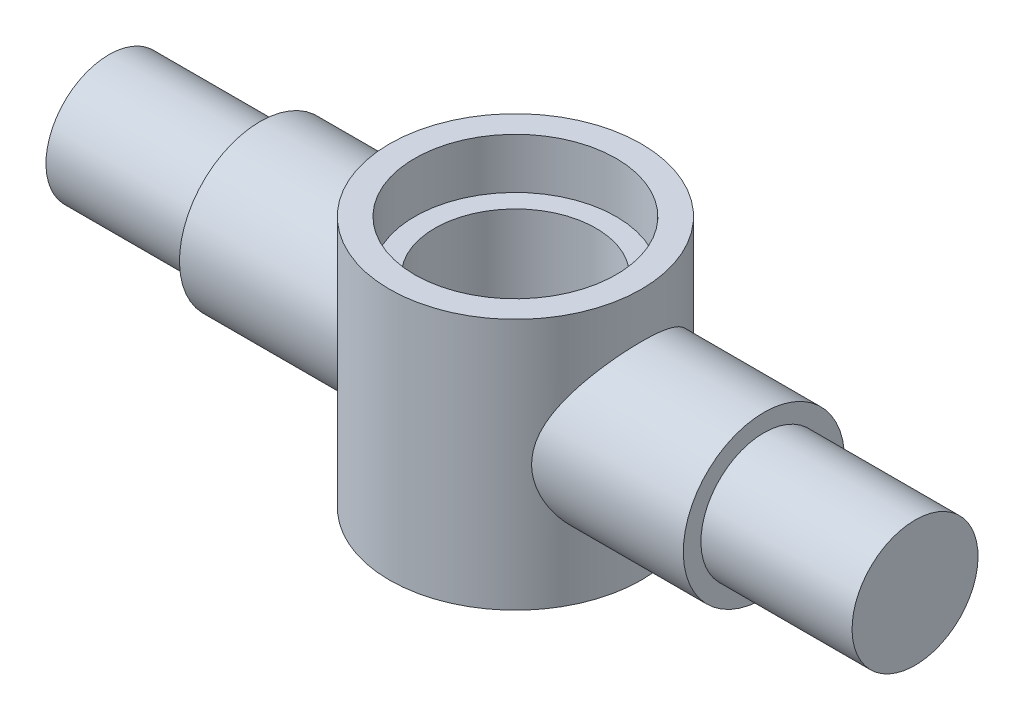
ISO-10303-21;
HEADER;
FILE_DESCRIPTION(('STEP AP214'),'2;1');
FILE_NAME('part.step','',(''),(''),'','','');
FILE_SCHEMA(('AUTOMOTIVE_DESIGN { 1 0 10303 214 1 1 1 1 }'));
ENDSEC;
DATA;
#1=APPLICATION_CONTEXT('core data for automotive mechanical design processes');
#2=APPLICATION_PROTOCOL_DEFINITION('international standard','automotive_design',2000,#1);
#3=PRODUCT_CONTEXT('',#1,'mechanical');
#4=PRODUCT('Part','Part','',(#3));
#5=PRODUCT_RELATED_PRODUCT_CATEGORY('part','',(#4));
#6=PRODUCT_DEFINITION_FORMATION('','',#4);
#7=PRODUCT_DEFINITION_CONTEXT('part definition',#1,'design');
#8=PRODUCT_DEFINITION('design','',#6,#7);
#9=PRODUCT_DEFINITION_SHAPE('','',#8);
#10=(LENGTH_UNIT() NAMED_UNIT(*) SI_UNIT(.MILLI.,.METRE.));
#11=(NAMED_UNIT(*) PLANE_ANGLE_UNIT() SI_UNIT($,.RADIAN.));
#12=(NAMED_UNIT(*) SI_UNIT($,.STERADIAN.) SOLID_ANGLE_UNIT());
#13=UNCERTAINTY_MEASURE_WITH_UNIT(LENGTH_MEASURE(1.E-05),#10,'distance_accuracy_value','');
#14=(GEOMETRIC_REPRESENTATION_CONTEXT(3) GLOBAL_UNCERTAINTY_ASSIGNED_CONTEXT((#13)) GLOBAL_UNIT_ASSIGNED_CONTEXT((#10,
#11,#12)) REPRESENTATION_CONTEXT('',''));
#15=CARTESIAN_POINT('',(0.,0.,0.));
#16=DIRECTION('',(0.,0.,1.));
#17=DIRECTION('',(1.,0.,0.));
#18=AXIS2_PLACEMENT_3D('',#15,#16,#17);
#19=CARTESIAN_POINT('',(25.,0.,0.));
#20=DIRECTION('',(0.,-1.,0.));
#21=DIRECTION('',(1.,0.,0.));
#22=AXIS2_PLACEMENT_3D('',#19,#20,#21);
#23=PLANE('',#22);
#24=CARTESIAN_POINT('',(25.,0.,0.));
#25=DIRECTION('',(0.,1.,0.));
#26=DIRECTION('',(-1.,0.,0.));
#27=AXIS2_PLACEMENT_3D('',#24,#25,#26);
#28=CIRCLE('',#27,25.);
#29=CARTESIAN_POINT('',(0.,0.,0.));
#30=VERTEX_POINT('',#29);
#31=EDGE_CURVE('E57',#30,#30,#28,.T.);
#32=ORIENTED_EDGE('',*,*,#31,.F.);
#33=EDGE_LOOP('',(#32));
#34=FACE_BOUND('',#33,.T.);
#35=CARTESIAN_POINT('',(25.,0.,0.));
#36=DIRECTION('',(0.,1.,0.));
#37=DIRECTION('',(0.,0.,1.));
#38=AXIS2_PLACEMENT_3D('',#35,#36,#37);
#39=CIRCLE('',#38,16.);
#40=CARTESIAN_POINT('',(25.,0.,16.));
#41=VERTEX_POINT('',#40);
#42=EDGE_CURVE('E114',#41,#41,#39,.T.);
#43=ORIENTED_EDGE('',*,*,#42,.T.);
#44=EDGE_LOOP('',(#43));
#45=FACE_BOUND('',#44,.T.);
#46=ADVANCED_FACE('F41',(#34,#45),#23,.T.);
#47=CARTESIAN_POINT('',(25.,50.,0.));
#48=DIRECTION('',(0.,1.,0.));
#49=DIRECTION('',(-1.,0.,0.));
#50=AXIS2_PLACEMENT_3D('',#47,#48,#49);
#51=CYLINDRICAL_SURFACE('',#50,25.);
#52=CARTESIAN_POINT('',(0.,8.99999999999998,0.));
#53=CARTESIAN_POINT('',(-1.56198817183265E-06,8.99999812268427,0.404925044071176));
#54=CARTESIAN_POINT('',(0.00985790233505375,9.0153900293615,0.809832411815946));
#55=CARTESIAN_POINT('',(0.0490489580311709,9.07673031711999,1.61652618236302));
#56=CARTESIAN_POINT('',(0.0783877374438591,9.12268997798419,2.01831137766447));
#57=CARTESIAN_POINT('',(0.15587135793951,9.24459012985987,2.81604821037114));
#58=CARTESIAN_POINT('',(0.204043418890826,9.32057401679456,3.2119905395922));
#59=CARTESIAN_POINT('',(0.318025996324268,9.50145916441724,3.99456099671031));
#60=CARTESIAN_POINT('',(0.383835120204193,9.60635814202158,4.38118985736236));
#61=CARTESIAN_POINT('',(0.531214452421046,9.84315317567685,5.1407660907412));
#62=CARTESIAN_POINT('',(0.612703810057813,9.97491094052897,5.51377244407855));
#63=CARTESIAN_POINT('',(0.789914415718777,10.2642840416398,6.24609510158277));
#64=CARTESIAN_POINT('',(0.885635895160982,10.4218997983604,6.60541118302289));
#65=CARTESIAN_POINT('',(1.0893675244986,10.7614332098507,7.30859986653981));
#66=CARTESIAN_POINT('',(1.19737463891809,10.9433448636325,7.65247625422317));
#67=CARTESIAN_POINT('',(1.42367453706457,11.3300437100849,8.32360019852907));
#68=CARTESIAN_POINT('',(1.54196863187976,11.5348338195922,8.6508456270696));
#69=CARTESIAN_POINT('',(1.79672487704247,11.9835171376261,9.31365412183655));
#70=CARTESIAN_POINT('',(1.93388176597135,12.2292380764864,9.64771274316307));
#71=CARTESIAN_POINT('',(2.21499359102065,12.7442633464195,10.2940617258667));
#72=CARTESIAN_POINT('',(2.35894883312868,13.0135687394739,10.6063511058609));
#73=CARTESIAN_POINT('',(2.6509977102151,13.5747907765348,11.2086687230747));
#74=CARTESIAN_POINT('',(2.79909650268537,13.8667364815179,11.4986673651025));
#75=CARTESIAN_POINT('',(3.09626559451641,14.4717980893445,12.0551203444099));
#76=CARTESIAN_POINT('',(3.24533592849056,14.7849147502183,12.3215738378621));
#77=CARTESIAN_POINT('',(3.56255008778447,15.4778002234219,12.8665793254927));
#78=CARTESIAN_POINT('',(3.73036103424933,15.8606856164832,13.1413799496497));
#79=CARTESIAN_POINT('',(4.05806208299021,16.651683814548,13.6575524379486));
#80=CARTESIAN_POINT('',(4.21795058661061,17.0598016741213,13.8989175727052));
#81=CARTESIAN_POINT('',(4.52401783406473,17.8994147531047,14.3459904698911));
#82=CARTESIAN_POINT('',(4.67021511563967,18.3308770771509,14.5517467761611));
#83=CARTESIAN_POINT('',(4.87478997105488,18.9943094460948,14.8320367864773));
#84=CARTESIAN_POINT('',(4.94052057748085,19.2181302463753,14.9207331379766));
#85=CARTESIAN_POINT('',(5.06634220571869,19.6710181010992,15.0884150598226));
#86=CARTESIAN_POINT('',(5.12643179941326,19.9000864658898,15.16739817266));
#87=CARTESIAN_POINT('',(5.2663051614987,20.4694477074645,15.3492623867947));
#88=CARTESIAN_POINT('',(5.3424522923507,20.8124861079796,15.4464497728831));
#89=CARTESIAN_POINT('',(5.47864152649098,21.5072346310028,15.6182136002394));
#90=CARTESIAN_POINT('',(5.53868772922925,21.8589425212266,15.6927957976356));
#91=CARTESIAN_POINT('',(5.64055970012612,22.5687302729839,15.8183001813279));
#92=CARTESIAN_POINT('',(5.68240831601843,22.9268015533606,15.8692520417559));
#93=CARTESIAN_POINT('',(5.74640434767621,23.6473419871101,15.9468367737907));
#94=CARTESIAN_POINT('',(5.76855154531203,24.0098111891308,15.9734693761403));
#95=CARTESIAN_POINT('',(5.79228706590541,24.7375398438493,16.0020035959886));
#96=CARTESIAN_POINT('',(5.79381096430315,25.1028044753721,16.0038277150333));
#97=CARTESIAN_POINT('',(5.77607024225664,25.8320914603995,15.9825126443981));
#98=CARTESIAN_POINT('',(5.75680551855,26.1961138077242,15.9593733307184));
#99=CARTESIAN_POINT('',(5.69825328720914,26.9203732822328,15.8885074198919));
#100=CARTESIAN_POINT('',(5.65895143825952,27.2806075093763,15.8407632118421));
#101=CARTESIAN_POINT('',(5.56183755255319,27.9945423910845,15.7214419318028));
#102=CARTESIAN_POINT('',(5.50402512600332,28.3482429078974,15.6498643579324));
#103=CARTESIAN_POINT('',(5.37392609689849,29.0365255860999,15.4863735674023));
#104=CARTESIAN_POINT('',(5.30212904417278,29.3713625698905,15.3951393603923));
#105=CARTESIAN_POINT('',(5.14517471683057,30.0316039752163,15.1921818732878));
#106=CARTESIAN_POINT('',(5.06001220526633,30.3570046398833,15.0804505589621));
#107=CARTESIAN_POINT('',(4.78783415965827,31.3172990085978,14.7159808896165));
#108=CARTESIAN_POINT('',(4.58405304140301,31.9366594201912,14.4338764142666));
#109=CARTESIAN_POINT('',(4.23727798199094,32.8867098662818,13.9270311591719));
#110=CARTESIAN_POINT('',(4.10287906979833,33.2331517366573,13.7249831568112));
#111=CARTESIAN_POINT('',(3.82778712483943,33.9082848078003,13.296696161189));
#112=CARTESIAN_POINT('',(3.68709350496816,34.2369743464777,13.0704549086854));
#113=CARTESIAN_POINT('',(3.40245640812741,34.8760245507426,12.5945655171766));
#114=CARTESIAN_POINT('',(3.25850961235503,35.1863652117508,12.3448925721126));
#115=CARTESIAN_POINT('',(2.97043516498369,35.7875537186817,11.823159163581));
#116=CARTESIAN_POINT('',(2.82630750299215,36.0784003868203,11.5510973496357));
#117=CARTESIAN_POINT('',(2.51454967621855,36.6908990129197,10.9336594778248));
#118=CARTESIAN_POINT('',(2.34743237586854,37.0084814733917,10.5839664649273));
#119=CARTESIAN_POINT('',(2.0211665453896,37.6131505683738,9.85558430354047));
#120=CARTESIAN_POINT('',(1.86201934833122,37.9002321102804,9.47689033099586));
#121=CARTESIAN_POINT('',(1.55600485087544,38.4413788795507,8.69230147452351));
#122=CARTESIAN_POINT('',(1.40912715251859,38.695472166599,8.28643015897212));
#123=CARTESIAN_POINT('',(1.20101324501069,39.0499422909588,7.65877791158845));
#124=CARTESIAN_POINT('',(1.13367950310593,39.1636478233454,7.44643333273027));
#125=CARTESIAN_POINT('',(1.00351676923808,39.3818943973732,7.01565570471913));
#126=CARTESIAN_POINT('',(0.94068894082306,39.4864330734262,6.79722110303668));
#127=CARTESIAN_POINT('',(0.783640362018523,39.7461292462035,6.22117702909599));
#128=CARTESIAN_POINT('',(0.693335416986595,39.8937970331853,5.85907262264253));
#129=CARTESIAN_POINT('',(0.527428956598975,40.1630462524394,5.12210088957014));
#130=CARTESIAN_POINT('',(0.451824793582059,40.2846323825155,4.74723587549781));
#131=CARTESIAN_POINT('',(0.316959128254057,40.5003093339702,3.98702789616476));
#132=CARTESIAN_POINT('',(0.257687543459783,40.5944171205238,3.60169155725472));
#133=CARTESIAN_POINT('',(0.156776698850457,40.7540335011103,2.82284294906273));
#134=CARTESIAN_POINT('',(0.115137766127057,40.8195415646094,2.42933052825374));
#135=CARTESIAN_POINT('',(0.0503760700251214,40.9212210484698,1.63564062619807));
#136=CARTESIAN_POINT('',(0.0273166832826481,40.9572920615261,1.23544504541874));
#137=CARTESIAN_POINT('',(0.000522238686042498,40.9991921444795,0.432822676299676));
#138=CARTESIAN_POINT('',(-0.00321281500696168,41.0050212078647,0.0303958874795079));
#139=CARTESIAN_POINT('',(0.00873491924922769,40.9863498172394,-0.773483996299116));
#140=CARTESIAN_POINT('',(0.0244188676198412,40.9618475507195,-1.17493703163257));
#141=CARTESIAN_POINT('',(0.0748163028941737,40.8828746268655,-1.97366097901498));
#142=CARTESIAN_POINT('',(0.109529296940924,40.8284047456999,-2.37093199910756));
#143=CARTESIAN_POINT('',(0.19479999586677,40.6939634497678,-3.13731209509082));
#144=CARTESIAN_POINT('',(0.244414961139862,40.6155053701039,-3.50679388900719));
#145=CARTESIAN_POINT('',(0.358894978839578,40.4333752681049,-4.23704308721496));
#146=CARTESIAN_POINT('',(0.423759366555056,40.3297043447724,-4.59781087058803));
#147=CARTESIAN_POINT('',(0.56745104564592,40.098267274378,-5.30867908099267));
#148=CARTESIAN_POINT('',(0.646279255035377,39.9704995431003,-5.65877880490657));
#149=CARTESIAN_POINT('',(0.816413763687928,39.6921060234087,-6.34662960165231));
#150=CARTESIAN_POINT('',(0.907720748724976,39.5414789787058,-6.68437999452994));
#151=CARTESIAN_POINT('',(1.10837242571746,39.2066584791476,-7.37070229752058));
#152=CARTESIAN_POINT('',(1.21855262927319,39.0208041517277,-7.71821923165124));
#153=CARTESIAN_POINT('',(1.44932169160555,38.6257168103069,-8.3960563865157));
#154=CARTESIAN_POINT('',(1.56991095850302,38.4164828795387,-8.72637593215575));
#155=CARTESIAN_POINT('',(1.81936979553602,37.9759241468037,-9.36895085200484));
#156=CARTESIAN_POINT('',(1.94824443890384,37.7445857670566,-9.6811949317172));
#157=CARTESIAN_POINT('',(2.21193981612649,37.2611877169458,-10.2865613887257));
#158=CARTESIAN_POINT('',(2.34676115136016,37.009125948624,-10.579681824615));
#159=CARTESIAN_POINT('',(2.64087062970049,36.4453931745428,-11.1893099340712));
#160=CARTESIAN_POINT('',(2.80075163463286,36.1304967694322,-11.5025558397825));
#161=CARTESIAN_POINT('',(3.12155940671436,35.4760453865055,-12.1016246389837));
#162=CARTESIAN_POINT('',(3.28248631967847,35.1364869002432,-12.3874436172205));
#163=CARTESIAN_POINT('',(3.60141915799818,34.4338377487856,-12.9305814468634));
#164=CARTESIAN_POINT('',(3.75942434435982,34.0707412319717,-13.1878931678842));
#165=CARTESIAN_POINT('',(4.06814384156568,33.322188513059,-13.6725981697187));
#166=CARTESIAN_POINT('',(4.21885925415272,32.9367357092736,-13.8999959805734));
#167=CARTESIAN_POINT('',(4.48857514280194,32.1986041155744,-14.2944225726149));
#168=CARTESIAN_POINT('',(4.60909837899761,31.848619370483,-14.4654551193313));
#169=CARTESIAN_POINT('',(4.83794259523465,31.1337720024687,-14.7827501975162));
#170=CARTESIAN_POINT('',(4.94626594273744,30.768912284905,-14.9290175376039));
#171=CARTESIAN_POINT('',(5.14723099845127,30.0259469850898,-15.1952420148147));
#172=CARTESIAN_POINT('',(5.23988958207276,29.6478561935389,-15.315227506719));
#173=CARTESIAN_POINT('',(5.40630246864348,28.8798750466482,-15.5275641940392));
#174=CARTESIAN_POINT('',(5.48005700535616,28.4899848372842,-15.6199157311731));
#175=CARTESIAN_POINT('',(5.60619433125048,27.6970861474701,-15.7762650376));
#176=CARTESIAN_POINT('',(5.65836362765541,27.2939872883618,-15.8399800811272));
#177=CARTESIAN_POINT('',(5.73781016824664,26.4816447778462,-15.9364986807434));
#178=CARTESIAN_POINT('',(5.76508805633217,26.0724012856687,-15.9693030364411));
#179=CARTESIAN_POINT('',(5.79334753544912,25.2519378820147,-16.0032809353728));
#180=CARTESIAN_POINT('',(5.79434525574141,24.8407193377404,-16.004473879882));
#181=CARTESIAN_POINT('',(5.77002719436439,24.0202173807875,-15.9752468012828));
#182=CARTESIAN_POINT('',(5.74471350954019,23.6109338165146,-15.9448292973182));
#183=CARTESIAN_POINT('',(5.6745654276942,22.8570140229211,-15.8596997261338));
#184=CARTESIAN_POINT('',(5.63308014526847,22.5115818283466,-15.8091331210736));
#185=CARTESIAN_POINT('',(5.5332827598235,21.8270252370755,-15.6860828655746));
#186=CARTESIAN_POINT('',(5.47496587319737,21.487902662804,-15.6135929841754));
#187=CARTESIAN_POINT('',(5.34334206526721,20.8176192579242,-15.4475564981701));
#188=CARTESIAN_POINT('',(5.27002562100976,20.4864636354068,-15.3539965127063));
#189=CARTESIAN_POINT('',(5.11053527613486,19.8336626652014,-15.1468238889593));
#190=CARTESIAN_POINT('',(5.02435963878908,19.5120186091617,-15.0332085416725));
#191=CARTESIAN_POINT('',(4.80975133743428,18.7700652037405,-14.7443693949179));
#192=CARTESIAN_POINT('',(4.6769968019824,18.3539982028307,-14.5614134998204));
#193=CARTESIAN_POINT('',(4.39744308159849,17.5427585234968,-14.1631148541737));
#194=CARTESIAN_POINT('',(4.2506442411209,17.1475853329942,-13.9477728978596));
#195=CARTESIAN_POINT('',(3.94768637908642,16.3788126586156,-13.4861556789325));
#196=CARTESIAN_POINT('',(3.79151583694121,16.0052408841273,-13.239841918056));
#197=CARTESIAN_POINT('',(3.4745067895303,15.2813195028843,-12.7179541719606));
#198=CARTESIAN_POINT('',(3.31366862870541,14.93096818884,-12.442382341833));
#199=CARTESIAN_POINT('',(2.98955776120199,14.2505775929872,-11.8597161505609));
#200=CARTESIAN_POINT('',(2.82627873933888,13.9208271398851,-11.5522878757903));
#201=CARTESIAN_POINT('',(2.50319754923522,13.2876022988094,-10.9097759508097));
#202=CARTESIAN_POINT('',(2.34339545410566,12.9841284629678,-10.5746917197737));
#203=CARTESIAN_POINT('',(2.0310418354948,12.4050614601661,-9.87788824812155));
#204=CARTESIAN_POINT('',(1.87849117772162,12.1294716177083,-9.51616584039962));
#205=CARTESIAN_POINT('',(1.65793781534625,11.7386501085569,-8.95480859407568));
#206=CARTESIAN_POINT('',(1.58579787540543,11.6121352502278,-8.76455786261007));
#207=CARTESIAN_POINT('',(1.44467629196686,11.3668292969539,-8.37789362684303));
#208=CARTESIAN_POINT('',(1.3756958404031,11.2480411099519,-8.18147784307569));
#209=CARTESIAN_POINT('',(1.16992553024818,10.8964762827568,-7.57072389698189));
#210=CARTESIAN_POINT('',(1.03901859790707,10.676789491621,-7.14672497942354));
#211=CARTESIAN_POINT('',(0.796420721132362,10.2745460712871,-6.27620668494683));
#212=CARTESIAN_POINT('',(0.684726454607826,10.0919830219705,-5.82969121870037));
#213=CARTESIAN_POINT('',(0.534289367298164,9.84826640160568,-5.14619804504744));
#214=CARTESIAN_POINT('',(0.487036317800453,9.77211504150387,-4.91633650685713));
#215=CARTESIAN_POINT('',(0.398539575824231,9.63006387098504,-4.45240645515483));
#216=CARTESIAN_POINT('',(0.35729424601443,9.56416126706104,-4.21833910749464));
#217=CARTESIAN_POINT('',(0.243139111243967,9.3823442661252,-3.51078593222693));
#218=CARTESIAN_POINT('',(0.179719774870797,9.28217522221578,-3.03154239159495));
#219=CARTESIAN_POINT('',(0.0871442856579882,9.13642371285529,-2.12784973800437));
#220=CARTESIAN_POINT('',(0.0545463103916828,9.08534244988568,-1.70461817648607));
#221=CARTESIAN_POINT('',(0.0109747468669737,9.01713119969598,-0.85425124641092));
#222=CARTESIAN_POINT('',(1.64758841984371E-06,9.00000198019656,-0.427115789798921));
#223=CARTESIAN_POINT('',(0.,8.99999999999998,0.));
#224=B_SPLINE_CURVE_WITH_KNOTS('',3,(#52,#53,#54,#55,#56,#57,#58,#59,#60,#61,#62,#63,#64,#65,
#66,#67,#68,#69,#70,#71,#72,#73,#74,#75,#76,#77,#78,#79,#80,#81,#82,#83,#84,#85,#86,#87,#88,#89,
#90,#91,#92,#93,#94,#95,#96,#97,#98,#99,#100,#101,#102,#103,#104,#105,#106,#107,#108,#109,#110,
#111,#112,#113,#114,#115,#116,#117,#118,#119,#120,#121,#122,#123,#124,#125,#126,#127,#128,#129,
#130,#131,#132,#133,#134,#135,#136,#137,#138,#139,#140,#141,#142,#143,#144,#145,#146,#147,#148,
#149,#150,#151,#152,#153,#154,#155,#156,#157,#158,#159,#160,#161,#162,#163,#164,#165,#166,#167,
#168,#169,#170,#171,#172,#173,#174,#175,#176,#177,#178,#179,#180,#181,#182,#183,#184,#185,#186,
#187,#188,#189,#190,#191,#192,#193,#194,#195,#196,#197,#198,#199,#200,#201,#202,#203,#204,#205,
#206,#207,#208,#209,#210,#211,#212,#213,#214,#215,#216,#217,#218,#219,#220,#221,#222,#223),
.UNSPECIFIED.,.T.,.F.,(4,2,2,2,2,2,2,2,2,2,2,2,2,2,2,2,2,2,2,2,2,2,2,2,2,2,2,2,2,2,2,2,2,2,2,2,
2,2,2,2,2,2,2,2,2,2,2,2,2,2,2,2,2,2,2,2,2,2,2,2,2,2,2,2,2,2,2,2,2,2,2,2,2,2,2,2,2,2,2,2,2,2,2,2,
2,4),(0.,1.21433590372909,2.42912015739384,3.64566667645103,4.86211716668029,6.07245576879059,
7.2828140534746,8.49287393554705,9.70308826789616,11.0121682302353,12.3213071693168,
13.6321552474755,14.9430502856901,16.4420715483407,17.9413940741466,19.4386562617971,
20.1870950354631,20.9357227808739,22.0283192451477,23.1206372592161,24.2115798402962,
25.3025344998955,26.3968963790282,27.4912636941612,28.5864153906037,29.6815901501144,
30.7437087697947,31.8062446000701,33.9301496941282,35.1981954835546,36.4663597906896,
37.7358821242904,39.0054810906213,40.5068568446586,42.0084828841258,43.5088231589307,
44.258900518937,45.0091708768569,46.2118707177269,47.4143537471899,48.6160927841587,
49.8178541128161,51.0236976145029,52.2295413758452,53.4354571982781,54.6413417886698,
55.7829773658004,56.9245631890967,58.0662240907687,59.2079477579223,60.4343408374661,
61.6607820235585,62.8879814611389,64.1153052891324,65.5300085169597,66.9449133972259,
68.3601713857365,69.775214806001,70.997381541078,72.2193106972438,73.439914981646,
74.6605041715842,75.8928927793549,77.1252495063834,78.3568498658442,79.5883520824207,
80.6419106900126,81.6957690183668,82.7502985106615,83.8049705540183,85.2234889733917,
86.6419726107123,88.0622371979518,89.4823972438031,90.9193332530907,92.3562994483688,
93.7934367662636,94.5120249362064,95.2308820013993,96.7140532599454,98.1969678027555,
98.9368252382388,99.6764806557275,101.154474230587,102.435329338598,103.716213408864),.UNSPECIFIED.);
#225=CARTESIAN_POINT('',(0.,8.99999999999998,0.));
#226=VERTEX_POINT('',#225);
#227=EDGE_CURVE('E10',#226,#226,#224,.T.);
#228=ORIENTED_EDGE('',*,*,#227,.F.);
#229=EDGE_LOOP('',(#228));
#230=FACE_BOUND('',#229,.T.);
#231=CARTESIAN_POINT('',(50.,41.,0.));
#232=CARTESIAN_POINT('',(50.0000015619882,41.0000018773157,0.404925044071176));
#233=CARTESIAN_POINT('',(49.990142097665,40.9846099706385,0.809832411815946));
#234=CARTESIAN_POINT('',(49.9509510419688,40.92326968288,1.61652618236302));
#235=CARTESIAN_POINT('',(49.9216122625562,40.8773100220158,2.01831137766447));
#236=CARTESIAN_POINT('',(49.8441286420605,40.7554098701401,2.81604821037115));
#237=CARTESIAN_POINT('',(49.7959565811092,40.6794259832054,3.2119905395922));
#238=CARTESIAN_POINT('',(49.6819740036757,40.4985408355827,3.99456099671031));
#239=CARTESIAN_POINT('',(49.6161648797958,40.3936418579784,4.38118985736236));
#240=CARTESIAN_POINT('',(49.468785547579,40.1568468243231,5.1407660907412));
#241=CARTESIAN_POINT('',(49.3872961899422,40.025089059471,5.51377244407855));
#242=CARTESIAN_POINT('',(49.2100855842812,39.7357159583602,6.24609510158277));
#243=CARTESIAN_POINT('',(49.114364104839,39.5781002016396,6.60541118302289));
#244=CARTESIAN_POINT('',(48.9106324755014,39.2385667901492,7.30859986653981));
#245=CARTESIAN_POINT('',(48.8026253610819,39.0566551363674,7.65247625422318));
#246=CARTESIAN_POINT('',(48.5763254629354,38.6699562899151,8.32360019852908));
#247=CARTESIAN_POINT('',(48.4580313681202,38.4651661804077,8.6508456270696));
#248=CARTESIAN_POINT('',(48.2032751229575,38.0164828623738,9.31365412183655));
#249=CARTESIAN_POINT('',(48.0661182340287,37.7707619235136,9.64771274316307));
#250=CARTESIAN_POINT('',(47.7850064089794,37.2557366535805,10.2940617258667));
#251=CARTESIAN_POINT('',(47.6410511668713,36.9864312605261,10.6063511058608));
#252=CARTESIAN_POINT('',(47.3490022897849,36.4252092234652,11.2086687230747));
#253=CARTESIAN_POINT('',(47.2009034973146,36.1332635184821,11.4986673651025));
#254=CARTESIAN_POINT('',(46.9037344054836,35.5282019106555,12.0551203444099));
#255=CARTESIAN_POINT('',(46.7546640715094,35.2150852497816,12.3215738378621));
#256=CARTESIAN_POINT('',(46.4374499122155,34.522199776578,12.8665793254927));
#257=CARTESIAN_POINT('',(46.2696389657507,34.1393143835168,13.1413799496497));
#258=CARTESIAN_POINT('',(45.9419379170098,33.348316185452,13.6575524379486));
#259=CARTESIAN_POINT('',(45.7820494133894,32.9401983258786,13.8989175727052));
#260=CARTESIAN_POINT('',(45.4759821659353,32.1005852468953,14.3459904698911));
#261=CARTESIAN_POINT('',(45.3297848843604,31.6691229228491,14.5517467761611));
#262=CARTESIAN_POINT('',(45.1252100289451,31.0056905539051,14.8320367864773));
#263=CARTESIAN_POINT('',(45.0594794225192,30.7818697536247,14.9207331379766));
#264=CARTESIAN_POINT('',(44.9336577942813,30.3289818989008,15.0884150598226));
#265=CARTESIAN_POINT('',(44.8735682005868,30.0999135341102,15.16739817266));
#266=CARTESIAN_POINT('',(44.7336948385013,29.5305522925354,15.3492623867947));
#267=CARTESIAN_POINT('',(44.6575477076493,29.1875138920204,15.4464497728831));
#268=CARTESIAN_POINT('',(44.521358473509,28.4927653689972,15.6182136002394));
#269=CARTESIAN_POINT('',(44.4613122707708,28.1410574787733,15.6927957976356));
#270=CARTESIAN_POINT('',(44.3594402998739,27.431269727016,15.8183001813279));
#271=CARTESIAN_POINT('',(44.3175916839816,27.0731984466394,15.8692520417559));
#272=CARTESIAN_POINT('',(44.2535956523238,26.3526580128898,15.9468367737907));
#273=CARTESIAN_POINT('',(44.231448454688,25.9901888108691,15.9734693761403));
#274=CARTESIAN_POINT('',(44.2077129340946,25.2624601561507,16.0020035959886));
#275=CARTESIAN_POINT('',(44.2061890356969,24.8971955246278,16.0038277150333));
#276=CARTESIAN_POINT('',(44.2239297577434,24.1679085396005,15.9825126443981));
#277=CARTESIAN_POINT('',(44.24319448145,23.8038861922758,15.9593733307184));
#278=CARTESIAN_POINT('',(44.3017467127909,23.0796267177671,15.8885074198919));
#279=CARTESIAN_POINT('',(44.3410485617405,22.7193924906237,15.8407632118421));
#280=CARTESIAN_POINT('',(44.4381624474468,22.0054576089155,15.7214419318028));
#281=CARTESIAN_POINT('',(44.4959748739967,21.6517570921026,15.6498643579324));
#282=CARTESIAN_POINT('',(44.6260739031015,20.9634744139,15.4863735674023));
#283=CARTESIAN_POINT('',(44.6978709558272,20.6286374301094,15.3951393603923));
#284=CARTESIAN_POINT('',(44.8548252831694,19.9683960247837,15.1921818732878));
#285=CARTESIAN_POINT('',(44.9399877947337,19.6429953601166,15.0804505589621));
#286=CARTESIAN_POINT('',(45.2121658403417,18.6827009914022,14.7159808896165));
#287=CARTESIAN_POINT('',(45.415946958597,18.0633405798088,14.4338764142666));
#288=CARTESIAN_POINT('',(45.7627220180091,17.1132901337182,13.9270311591719));
#289=CARTESIAN_POINT('',(45.8971209302017,16.7668482633426,13.7249831568112));
#290=CARTESIAN_POINT('',(46.1722128751606,16.0917151921996,13.296696161189));
#291=CARTESIAN_POINT('',(46.3129064950318,15.7630256535223,13.0704549086854));
#292=CARTESIAN_POINT('',(46.5975435918726,15.1239754492574,12.5945655171766));
#293=CARTESIAN_POINT('',(46.741490387645,14.8136347882492,12.3448925721126));
#294=CARTESIAN_POINT('',(47.0295648350163,14.2124462813183,11.823159163581));
#295=CARTESIAN_POINT('',(47.1736924970079,13.9215996131797,11.5510973496357));
#296=CARTESIAN_POINT('',(47.4854503237815,13.3091009870803,10.9336594778248));
#297=CARTESIAN_POINT('',(47.6525676241315,12.9915185266083,10.5839664649273));
#298=CARTESIAN_POINT('',(47.9788334546104,12.3868494316262,9.85558430354047));
#299=CARTESIAN_POINT('',(48.1379806516688,12.0997678897196,9.47689033099586));
#300=CARTESIAN_POINT('',(48.4439951491246,11.5586211204492,8.69230147452352));
#301=CARTESIAN_POINT('',(48.5908728474814,11.304527833401,8.28643015897212));
#302=CARTESIAN_POINT('',(48.7989867549893,10.9500577090412,7.65877791158845));
#303=CARTESIAN_POINT('',(48.8663204968941,10.8363521766546,7.44643333273028));
#304=CARTESIAN_POINT('',(48.9964832307619,10.6181056026268,7.01565570471914));
#305=CARTESIAN_POINT('',(49.0593110591769,10.5135669265738,6.79722110303668));
#306=CARTESIAN_POINT('',(49.2163596379815,10.2538707537965,6.22117702909599));
#307=CARTESIAN_POINT('',(49.3066645830134,10.1062029668147,5.85907262264253));
#308=CARTESIAN_POINT('',(49.472571043401,9.83695374756054,5.12210088957014));
#309=CARTESIAN_POINT('',(49.5481752064179,9.71536761748443,4.7472358754978));
#310=CARTESIAN_POINT('',(49.683040871746,9.49969066602974,3.98702789616476));
#311=CARTESIAN_POINT('',(49.7423124565402,9.40558287947619,3.60169155725472));
#312=CARTESIAN_POINT('',(49.8432233011496,9.2459664988897,2.82284294906273));
#313=CARTESIAN_POINT('',(49.884862233873,9.18045843539057,2.42933052825374));
#314=CARTESIAN_POINT('',(49.9496239299749,9.07877895153019,1.63564062619807));
#315=CARTESIAN_POINT('',(49.9726833167174,9.0427079384739,1.23544504541875));
#316=CARTESIAN_POINT('',(49.999477761314,9.00080785552044,0.432822676299684));
#317=CARTESIAN_POINT('',(50.003212815007,8.9949787921353,0.0303958874795142));
#318=CARTESIAN_POINT('',(49.9912650807508,9.01365018276062,-0.77348399629911));
#319=CARTESIAN_POINT('',(49.9755811323802,9.03815244928051,-1.17493703163256));
#320=CARTESIAN_POINT('',(49.9251836971058,9.11712537313446,-1.97366097901497));
#321=CARTESIAN_POINT('',(49.8904707030591,9.17159525430004,-2.37093199910755));
#322=CARTESIAN_POINT('',(49.8052000041332,9.30603655023217,-3.13731209509081));
#323=CARTESIAN_POINT('',(49.7555850388601,9.38449462989609,-3.50679388900719));
#324=CARTESIAN_POINT('',(49.6411050211604,9.56662473189511,-4.23704308721495));
#325=CARTESIAN_POINT('',(49.576240633445,9.67029565522762,-4.59781087058803));
#326=CARTESIAN_POINT('',(49.4325489543541,9.90173272562199,-5.30867908099266));
#327=CARTESIAN_POINT('',(49.3537207449646,10.0295004568997,-5.65877880490657));
#328=CARTESIAN_POINT('',(49.1835862363121,10.3078939765913,-6.3466296016523));
#329=CARTESIAN_POINT('',(49.092279251275,10.4585210212942,-6.68437999452994));
#330=CARTESIAN_POINT('',(48.8916275742826,10.7933415208523,-7.37070229752058));
#331=CARTESIAN_POINT('',(48.7814473707268,10.9791958482723,-7.71821923165124));
#332=CARTESIAN_POINT('',(48.5506783083945,11.3742831896931,-8.3960563865157));
#333=CARTESIAN_POINT('',(48.430089041497,11.5835171204612,-8.72637593215575));
#334=CARTESIAN_POINT('',(48.180630204464,12.0240758531963,-9.36895085200484));
#335=CARTESIAN_POINT('',(48.0517555610962,12.2554142329434,-9.6811949317172));
#336=CARTESIAN_POINT('',(47.7880601838735,12.7388122830541,-10.2865613887257));
#337=CARTESIAN_POINT('',(47.6532388486399,12.9908740513759,-10.579681824615));
#338=CARTESIAN_POINT('',(47.3591293702995,13.5546068254572,-11.1893099340712));
#339=CARTESIAN_POINT('',(47.1992483653671,13.8695032305678,-11.5025558397825));
#340=CARTESIAN_POINT('',(46.8784405932857,14.5239546134945,-12.1016246389836));
#341=CARTESIAN_POINT('',(46.7175136803215,14.8635130997567,-12.3874436172205));
#342=CARTESIAN_POINT('',(46.3985808420018,15.5661622512144,-12.9305814468634));
#343=CARTESIAN_POINT('',(46.2405756556402,15.9292587680283,-13.1878931678842));
#344=CARTESIAN_POINT('',(45.9318561584343,16.677811486941,-13.6725981697187));
#345=CARTESIAN_POINT('',(45.7811407458473,17.0632642907263,-13.8999959805734));
#346=CARTESIAN_POINT('',(45.5114248571981,17.8013958844256,-14.2944225726149));
#347=CARTESIAN_POINT('',(45.3909016210024,18.151380629517,-14.4654551193313));
#348=CARTESIAN_POINT('',(45.1620574047653,18.8662279975313,-14.7827501975162));
#349=CARTESIAN_POINT('',(45.0537340572626,19.231087715095,-14.9290175376039));
#350=CARTESIAN_POINT('',(44.8527690015487,19.9740530149101,-15.1952420148147));
#351=CARTESIAN_POINT('',(44.7601104179272,20.352143806461,-15.315227506719));
#352=CARTESIAN_POINT('',(44.5936975313565,21.1201249533518,-15.5275641940392));
#353=CARTESIAN_POINT('',(44.5199429946438,21.5100151627158,-15.6199157311731));
#354=CARTESIAN_POINT('',(44.3938056687495,22.3029138525299,-15.7762650376));
#355=CARTESIAN_POINT('',(44.3416363723446,22.7060127116382,-15.8399800811272));
#356=CARTESIAN_POINT('',(44.2621898317534,23.5183552221538,-15.9364986807434));
#357=CARTESIAN_POINT('',(44.2349119436678,23.9275987143313,-15.9693030364411));
#358=CARTESIAN_POINT('',(44.2066524645509,24.7480621179853,-16.0032809353728));
#359=CARTESIAN_POINT('',(44.2056547442586,25.1592806622595,-16.004473879882));
#360=CARTESIAN_POINT('',(44.2299728056356,25.9797826192125,-15.9752468012828));
#361=CARTESIAN_POINT('',(44.2552864904598,26.3890661834853,-15.9448292973182));
#362=CARTESIAN_POINT('',(44.3254345723058,27.1429859770789,-15.8596997261338));
#363=CARTESIAN_POINT('',(44.3669198547315,27.4884181716534,-15.8091331210736));
#364=CARTESIAN_POINT('',(44.4667172401765,28.1729747629245,-15.6860828655746));
#365=CARTESIAN_POINT('',(44.5250341268026,28.512097337196,-15.6135929841754));
#366=CARTESIAN_POINT('',(44.6566579347328,29.1823807420757,-15.4475564981701));
#367=CARTESIAN_POINT('',(44.7299743789903,29.5135363645932,-15.3539965127063));
#368=CARTESIAN_POINT('',(44.8894647238652,30.1663373347986,-15.1468238889592));
#369=CARTESIAN_POINT('',(44.9756403612109,30.4879813908382,-15.0332085416725));
#370=CARTESIAN_POINT('',(45.1902486625657,31.2299347962595,-14.7443693949179));
#371=CARTESIAN_POINT('',(45.3230031980176,31.6460017971692,-14.5614134998204));
#372=CARTESIAN_POINT('',(45.6025569184015,32.4572414765032,-14.1631148541737));
#373=CARTESIAN_POINT('',(45.7493557588791,32.8524146670058,-13.9477728978596));
#374=CARTESIAN_POINT('',(46.0523136209136,33.6211873413844,-13.4861556789324));
#375=CARTESIAN_POINT('',(46.2084841630588,33.9947591158727,-13.239841918056));
#376=CARTESIAN_POINT('',(46.5254932104697,34.7186804971156,-12.7179541719606));
#377=CARTESIAN_POINT('',(46.6863313712946,35.0690318111599,-12.442382341833));
#378=CARTESIAN_POINT('',(47.010442238798,35.7494224070127,-11.8597161505609));
#379=CARTESIAN_POINT('',(47.1737212606611,36.0791728601149,-11.5522878757903));
#380=CARTESIAN_POINT('',(47.4968024507648,36.7123977011906,-10.9097759508097));
#381=CARTESIAN_POINT('',(47.6566045458944,37.0158715370322,-10.5746917197736));
#382=CARTESIAN_POINT('',(47.9689581645052,37.5949385398338,-9.87788824812153));
#383=CARTESIAN_POINT('',(48.1215088222784,37.8705283822917,-9.51616584039961));
#384=CARTESIAN_POINT('',(48.3420621846538,38.2613498914431,-8.95480859407566));
#385=CARTESIAN_POINT('',(48.4142021245946,38.3878647497722,-8.76455786261006));
#386=CARTESIAN_POINT('',(48.5553237080332,38.6331707030461,-8.37789362684302));
#387=CARTESIAN_POINT('',(48.6243041595969,38.7519588900481,-8.18147784307568));
#388=CARTESIAN_POINT('',(48.8300744697518,39.1035237172432,-7.57072389698188));
#389=CARTESIAN_POINT('',(48.9609814020929,39.323210508379,-7.14672497942354));
#390=CARTESIAN_POINT('',(49.2035792788677,39.7254539287129,-6.27620668494682));
#391=CARTESIAN_POINT('',(49.3152735453922,39.9080169780295,-5.82969121870036));
#392=CARTESIAN_POINT('',(49.4657106327018,40.1517335983943,-5.14619804504743));
#393=CARTESIAN_POINT('',(49.5129636821996,40.2278849584961,-4.91633650685712));
#394=CARTESIAN_POINT('',(49.6014604241758,40.3699361290149,-4.45240645515483));
#395=CARTESIAN_POINT('',(49.6427057539856,40.4358387329389,-4.21833910749463));
#396=CARTESIAN_POINT('',(49.756860888756,40.6176557338748,-3.51078593222692));
#397=CARTESIAN_POINT('',(49.8202802251292,40.7178247777842,-3.03154239159494));
#398=CARTESIAN_POINT('',(49.912855714342,40.8635762871447,-2.12784973800436));
#399=CARTESIAN_POINT('',(49.9454536896083,40.9146575501143,-1.70461817648606));
#400=CARTESIAN_POINT('',(49.989025253133,40.982868800304,-0.854251246410917));
#401=CARTESIAN_POINT('',(49.9999983524116,40.9999980198034,-0.42711578979892));
#402=CARTESIAN_POINT('',(50.,41.,0.));
#403=B_SPLINE_CURVE_WITH_KNOTS('',3,(#231,#232,#233,#234,#235,#236,#237,#238,#239,#240,#241,
#242,#243,#244,#245,#246,#247,#248,#249,#250,#251,#252,#253,#254,#255,#256,#257,#258,#259,#260,
#261,#262,#263,#264,#265,#266,#267,#268,#269,#270,#271,#272,#273,#274,#275,#276,#277,#278,#279,
#280,#281,#282,#283,#284,#285,#286,#287,#288,#289,#290,#291,#292,#293,#294,#295,#296,#297,#298,
#299,#300,#301,#302,#303,#304,#305,#306,#307,#308,#309,#310,#311,#312,#313,#314,#315,#316,#317,
#318,#319,#320,#321,#322,#323,#324,#325,#326,#327,#328,#329,#330,#331,#332,#333,#334,#335,#336,
#337,#338,#339,#340,#341,#342,#343,#344,#345,#346,#347,#348,#349,#350,#351,#352,#353,#354,#355,
#356,#357,#358,#359,#360,#361,#362,#363,#364,#365,#366,#367,#368,#369,#370,#371,#372,#373,#374,
#375,#376,#377,#378,#379,#380,#381,#382,#383,#384,#385,#386,#387,#388,#389,#390,#391,#392,#393,
#394,#395,#396,#397,#398,#399,#400,#401,#402),.UNSPECIFIED.,.T.,.F.,(4,2,2,2,2,2,2,2,2,2,2,2,2,
2,2,2,2,2,2,2,2,2,2,2,2,2,2,2,2,2,2,2,2,2,2,2,2,2,2,2,2,2,2,2,2,2,2,2,2,2,2,2,2,2,2,2,2,2,2,2,2,
2,2,2,2,2,2,2,2,2,2,2,2,2,2,2,2,2,2,2,2,2,2,2,2,4),(0.,1.21433590372909,2.42912015739384,
3.64566667645103,4.86211716668028,6.07245576879059,7.28281405347461,8.49287393554705,
9.70308826789616,11.0121682302353,12.3213071693168,13.6321552474755,14.9430502856901,
16.4420715483407,17.9413940741466,19.4386562617971,20.1870950354631,20.9357227808739,
22.0283192451477,23.120637259216,24.2115798402962,25.3025344998955,26.3968963790282,
27.4912636941612,28.5864153906037,29.6815901501144,30.7437087697947,31.8062446000701,
33.9301496941282,35.1981954835546,36.4663597906896,37.7358821242905,39.0054810906213,
40.5068568446586,42.0084828841258,43.5088231589307,44.258900518937,45.0091708768569,
46.2118707177269,47.4143537471899,48.6160927841587,49.8178541128161,51.0236976145029,
52.2295413758452,53.4354571982781,54.6413417886698,55.7829773658004,56.9245631890967,
58.0662240907687,59.2079477579223,60.4343408374661,61.6607820235585,62.8879814611388,
64.1153052891324,65.5300085169597,66.9449133972259,68.3601713857365,69.775214806001,
70.997381541078,72.2193106972438,73.439914981646,74.6605041715842,75.8928927793549,
77.1252495063834,78.3568498658442,79.5883520824207,80.6419106900126,81.6957690183668,
82.7502985106616,83.8049705540183,85.2234889733917,86.6419726107124,88.0622371979518,
89.4823972438031,90.9193332530907,92.3562994483688,93.7934367662637,94.5120249362064,
95.2308820013993,96.7140532599454,98.1969678027555,98.9368252382388,99.6764806557275,
101.154474230587,102.435329338598,103.716213408864),.UNSPECIFIED.);
#404=CARTESIAN_POINT('',(50.,41.,0.));
#405=VERTEX_POINT('',#404);
#406=EDGE_CURVE('E52',#405,#405,#403,.T.);
#407=ORIENTED_EDGE('',*,*,#406,.F.);
#408=EDGE_LOOP('',(#407));
#409=FACE_BOUND('',#408,.T.);
#410=ORIENTED_EDGE('',*,*,#31,.T.);
#411=EDGE_LOOP('',(#410));
#412=FACE_BOUND('',#411,.T.);
#413=CARTESIAN_POINT('',(25.,50.,0.));
#414=DIRECTION('',(0.,1.,0.));
#415=DIRECTION('',(-1.,0.,0.));
#416=AXIS2_PLACEMENT_3D('',#413,#414,#415);
#417=CIRCLE('',#416,25.);
#418=CARTESIAN_POINT('',(0.,50.,0.));
#419=VERTEX_POINT('',#418);
#420=EDGE_CURVE('E62',#419,#419,#417,.T.);
#421=ORIENTED_EDGE('',*,*,#420,.F.);
#422=EDGE_LOOP('',(#421));
#423=FACE_BOUND('',#422,.T.);
#424=ADVANCED_FACE('F68',(#230,#409,#412,#423),#51,.T.);
#425=CARTESIAN_POINT('',(0.,50.,0.));
#426=DIRECTION('',(0.,1.,0.));
#427=DIRECTION('',(-1.,0.,0.));
#428=AXIS2_PLACEMENT_3D('',#425,#426,#427);
#429=PLANE('',#428);
#430=CARTESIAN_POINT('',(25.,50.,0.));
#431=DIRECTION('',(0.,1.,0.));
#432=DIRECTION('',(0.,0.,1.));
#433=AXIS2_PLACEMENT_3D('',#430,#431,#432);
#434=CIRCLE('',#433,20.);
#435=CARTESIAN_POINT('',(25.,50.,20.));
#436=VERTEX_POINT('',#435);
#437=EDGE_CURVE('E291',#436,#436,#434,.T.);
#438=ORIENTED_EDGE('',*,*,#437,.F.);
#439=EDGE_LOOP('',(#438));
#440=FACE_BOUND('',#439,.T.);
#441=ORIENTED_EDGE('',*,*,#420,.T.);
#442=EDGE_LOOP('',(#441));
#443=FACE_BOUND('',#442,.T.);
#444=ADVANCED_FACE('F92',(#440,#443),#429,.T.);
#445=CARTESIAN_POINT('',(104.321769291862,37.5,0.));
#446=DIRECTION('',(1.,0.,0.));
#447=DIRECTION('',(0.,1.,0.));
#448=AXIS2_PLACEMENT_3D('',#445,#446,#447);
#449=PLANE('',#448);
#450=CARTESIAN_POINT('',(104.321769291862,25.,0.));
#451=DIRECTION('',(1.,0.,0.));
#452=DIRECTION('',(0.,1.,0.));
#453=AXIS2_PLACEMENT_3D('',#450,#451,#452);
#454=CIRCLE('',#453,12.5);
#455=CARTESIAN_POINT('',(104.321769291862,37.5,0.));
#456=VERTEX_POINT('',#455);
#457=EDGE_CURVE('E117',#456,#456,#454,.T.);
#458=ORIENTED_EDGE('',*,*,#457,.T.);
#459=EDGE_LOOP('',(#458));
#460=FACE_BOUND('',#459,.T.);
#461=ADVANCED_FACE('F94',(#460),#449,.T.);
#462=CARTESIAN_POINT('',(104.321769291862,25.,0.));
#463=DIRECTION('',(1.,0.,0.));
#464=DIRECTION('',(0.,1.,0.));
#465=AXIS2_PLACEMENT_3D('',#462,#463,#464);
#466=CYLINDRICAL_SURFACE('',#465,12.5);
#467=CARTESIAN_POINT('',(74.3217692918619,25.,0.));
#468=DIRECTION('',(1.,0.,0.));
#469=DIRECTION('',(0.,1.,0.));
#470=AXIS2_PLACEMENT_3D('',#467,#468,#469);
#471=CIRCLE('',#470,12.5);
#472=CARTESIAN_POINT('',(74.3217692918619,37.5,0.));
#473=VERTEX_POINT('',#472);
#474=EDGE_CURVE('E123',#473,#473,#471,.T.);
#475=ORIENTED_EDGE('',*,*,#474,.T.);
#476=EDGE_LOOP('',(#475));
#477=FACE_BOUND('',#476,.T.);
#478=ORIENTED_EDGE('',*,*,#457,.F.);
#479=EDGE_LOOP('',(#478));
#480=FACE_BOUND('',#479,.T.);
#481=ADVANCED_FACE('F100',(#477,#480),#466,.T.);
#482=CARTESIAN_POINT('',(74.3217692918619,41.,0.));
#483=DIRECTION('',(1.,0.,0.));
#484=DIRECTION('',(0.,1.,0.));
#485=AXIS2_PLACEMENT_3D('',#482,#483,#484);
#486=PLANE('',#485);
#487=CARTESIAN_POINT('',(74.3217692918619,25.,0.));
#488=DIRECTION('',(1.,0.,0.));
#489=DIRECTION('',(0.,1.,0.));
#490=AXIS2_PLACEMENT_3D('',#487,#488,#489);
#491=CIRCLE('',#490,16.);
#492=CARTESIAN_POINT('',(74.3217692918619,41.,0.));
#493=VERTEX_POINT('',#492);
#494=EDGE_CURVE('E133',#493,#493,#491,.T.);
#495=ORIENTED_EDGE('',*,*,#494,.T.);
#496=EDGE_LOOP('',(#495));
#497=FACE_BOUND('',#496,.T.);
#498=ORIENTED_EDGE('',*,*,#474,.F.);
#499=EDGE_LOOP('',(#498));
#500=FACE_BOUND('',#499,.T.);
#501=ADVANCED_FACE('F77',(#497,#500),#486,.T.);
#502=CARTESIAN_POINT('',(104.321769291862,25.,0.));
#503=DIRECTION('',(1.,0.,0.));
#504=DIRECTION('',(0.,1.,0.));
#505=AXIS2_PLACEMENT_3D('',#502,#503,#504);
#506=CYLINDRICAL_SURFACE('',#505,16.);
#507=ORIENTED_EDGE('',*,*,#406,.T.);
#508=EDGE_LOOP('',(#507));
#509=FACE_BOUND('',#508,.T.);
#510=ORIENTED_EDGE('',*,*,#494,.F.);
#511=EDGE_LOOP('',(#510));
#512=FACE_BOUND('',#511,.T.);
#513=ADVANCED_FACE('F71',(#509,#512),#506,.T.);
#514=ORIENTED_EDGE('',*,*,#227,.T.);
#515=EDGE_LOOP('',(#514));
#516=FACE_BOUND('',#515,.T.);
#517=CARTESIAN_POINT('',(-25.6782307081381,25.,0.));
#518=DIRECTION('',(1.,0.,0.));
#519=DIRECTION('',(0.,1.,0.));
#520=AXIS2_PLACEMENT_3D('',#517,#518,#519);
#521=CIRCLE('',#520,16.);
#522=CARTESIAN_POINT('',(-25.6782307081381,41.,0.));
#523=VERTEX_POINT('',#522);
#524=EDGE_CURVE('E137',#523,#523,#521,.T.);
#525=ORIENTED_EDGE('',*,*,#524,.T.);
#526=EDGE_LOOP('',(#525));
#527=FACE_BOUND('',#526,.T.);
#528=ADVANCED_FACE('F76',(#516,#527),#506,.T.);
#529=CARTESIAN_POINT('',(-55.6782307081381,25.,0.));
#530=DIRECTION('',(-1.,0.,0.));
#531=DIRECTION('',(0.,-1.,0.));
#532=AXIS2_PLACEMENT_3D('',#529,#530,#531);
#533=PLANE('',#532);
#534=CARTESIAN_POINT('',(-55.6782307081381,25.,0.));
#535=DIRECTION('',(1.,0.,0.));
#536=DIRECTION('',(0.,1.,0.));
#537=AXIS2_PLACEMENT_3D('',#534,#535,#536);
#538=CIRCLE('',#537,12.5);
#539=CARTESIAN_POINT('',(-55.6782307081381,37.5,0.));
#540=VERTEX_POINT('',#539);
#541=EDGE_CURVE('E145',#540,#540,#538,.T.);
#542=ORIENTED_EDGE('',*,*,#541,.F.);
#543=EDGE_LOOP('',(#542));
#544=FACE_BOUND('',#543,.T.);
#545=ADVANCED_FACE('F88',(#544),#533,.T.);
#546=CARTESIAN_POINT('',(104.321769291862,25.,0.));
#547=DIRECTION('',(1.,0.,0.));
#548=DIRECTION('',(0.,1.,0.));
#549=AXIS2_PLACEMENT_3D('',#546,#547,#548);
#550=CYLINDRICAL_SURFACE('',#549,12.5);
#551=ORIENTED_EDGE('',*,*,#541,.T.);
#552=EDGE_LOOP('',(#551));
#553=FACE_BOUND('',#552,.T.);
#554=CARTESIAN_POINT('',(-25.6782307081381,25.,0.));
#555=DIRECTION('',(1.,0.,0.));
#556=DIRECTION('',(0.,1.,0.));
#557=AXIS2_PLACEMENT_3D('',#554,#555,#556);
#558=CIRCLE('',#557,12.5);
#559=CARTESIAN_POINT('',(-25.6782307081381,37.5,0.));
#560=VERTEX_POINT('',#559);
#561=EDGE_CURVE('E141',#560,#560,#558,.T.);
#562=ORIENTED_EDGE('',*,*,#561,.F.);
#563=EDGE_LOOP('',(#562));
#564=FACE_BOUND('',#563,.T.);
#565=ADVANCED_FACE('F84',(#553,#564),#550,.T.);
#566=CARTESIAN_POINT('',(-25.6782307081381,37.5,0.));
#567=DIRECTION('',(-1.,0.,0.));
#568=DIRECTION('',(0.,-1.,0.));
#569=AXIS2_PLACEMENT_3D('',#566,#567,#568);
#570=PLANE('',#569);
#571=ORIENTED_EDGE('',*,*,#561,.T.);
#572=EDGE_LOOP('',(#571));
#573=FACE_BOUND('',#572,.T.);
#574=ORIENTED_EDGE('',*,*,#524,.F.);
#575=EDGE_LOOP('',(#574));
#576=FACE_BOUND('',#575,.T.);
#577=ADVANCED_FACE('F79',(#573,#576),#570,.T.);
#578=CARTESIAN_POINT('',(25.,50.,0.));
#579=DIRECTION('',(0.,1.,0.));
#580=DIRECTION('',(0.,0.,1.));
#581=AXIS2_PLACEMENT_3D('',#578,#579,#580);
#582=CYLINDRICAL_SURFACE('',#581,16.);
#583=ORIENTED_EDGE('',*,*,#42,.F.);
#584=EDGE_LOOP('',(#583));
#585=FACE_BOUND('',#584,.T.);
#586=CARTESIAN_POINT('',(25.,40.,0.));
#587=DIRECTION('',(0.,1.,0.));
#588=DIRECTION('',(0.,0.,1.));
#589=AXIS2_PLACEMENT_3D('',#586,#587,#588);
#590=CIRCLE('',#589,16.);
#591=CARTESIAN_POINT('',(25.,40.,16.));
#592=VERTEX_POINT('',#591);
#593=EDGE_CURVE('E118',#592,#592,#590,.T.);
#594=ORIENTED_EDGE('',*,*,#593,.T.);
#595=EDGE_LOOP('',(#594));
#596=FACE_BOUND('',#595,.T.);
#597=ADVANCED_FACE('F83',(#585,#596),#582,.F.);
#598=CARTESIAN_POINT('',(41.,40.,0.));
#599=DIRECTION('',(0.,-1.,0.));
#600=DIRECTION('',(0.,0.,-1.));
#601=AXIS2_PLACEMENT_3D('',#598,#599,#600);
#602=PLANE('',#601);
#603=ORIENTED_EDGE('',*,*,#593,.F.);
#604=EDGE_LOOP('',(#603));
#605=FACE_BOUND('',#604,.T.);
#606=CARTESIAN_POINT('',(25.,40.,0.));
#607=DIRECTION('',(0.,1.,0.));
#608=DIRECTION('',(0.,0.,1.));
#609=AXIS2_PLACEMENT_3D('',#606,#607,#608);
#610=CIRCLE('',#609,20.);
#611=CARTESIAN_POINT('',(25.,40.,20.));
#612=VERTEX_POINT('',#611);
#613=EDGE_CURVE('E126',#612,#612,#610,.T.);
#614=ORIENTED_EDGE('',*,*,#613,.T.);
#615=EDGE_LOOP('',(#614));
#616=FACE_BOUND('',#615,.T.);
#617=ADVANCED_FACE('F182',(#605,#616),#602,.F.);
#618=CARTESIAN_POINT('',(25.,50.,0.));
#619=DIRECTION('',(0.,1.,0.));
#620=DIRECTION('',(0.,0.,1.));
#621=AXIS2_PLACEMENT_3D('',#618,#619,#620);
#622=CYLINDRICAL_SURFACE('',#621,20.);
#623=ORIENTED_EDGE('',*,*,#613,.F.);
#624=EDGE_LOOP('',(#623));
#625=FACE_BOUND('',#624,.T.);
#626=ORIENTED_EDGE('',*,*,#437,.T.);
#627=EDGE_LOOP('',(#626));
#628=FACE_BOUND('',#627,.T.);
#629=ADVANCED_FACE('F189',(#625,#628),#622,.F.);
#630=CLOSED_SHELL('',(#46,#424,#444,#461,#481,#501,#513,#528,#545,#565,#577,#597,#617,#629));
#631=MANIFOLD_SOLID_BREP('B2',#630);
#632=ADVANCED_BREP_SHAPE_REPRESENTATION('',(#18,#631),#14);
#633=SHAPE_DEFINITION_REPRESENTATION(#9,#632);
ENDSEC;
END-ISO-10303-21;
